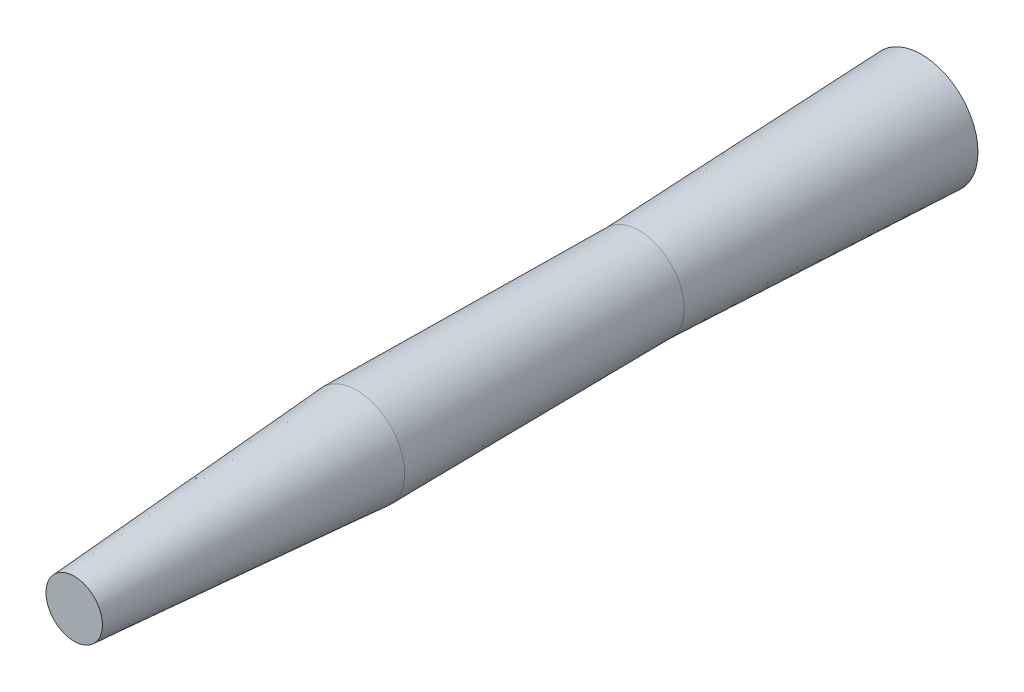
ISO-10303-21;
HEADER;
FILE_DESCRIPTION(('STEP AP214'),'2;1');
FILE_NAME('part.step','',(''),(''),'','','');
FILE_SCHEMA(('AUTOMOTIVE_DESIGN { 1 0 10303 214 1 1 1 1 }'));
ENDSEC;
DATA;
#1=APPLICATION_CONTEXT('core data for automotive mechanical design processes');
#2=APPLICATION_PROTOCOL_DEFINITION('international standard','automotive_design',2000,#1);
#3=PRODUCT_CONTEXT('',#1,'mechanical');
#4=PRODUCT('Part','Part','',(#3));
#5=PRODUCT_RELATED_PRODUCT_CATEGORY('part','',(#4));
#6=PRODUCT_DEFINITION_FORMATION('','',#4);
#7=PRODUCT_DEFINITION_CONTEXT('part definition',#1,'design');
#8=PRODUCT_DEFINITION('design','',#6,#7);
#9=PRODUCT_DEFINITION_SHAPE('','',#8);
#10=(LENGTH_UNIT() NAMED_UNIT(*) SI_UNIT(.MILLI.,.METRE.));
#11=(NAMED_UNIT(*) PLANE_ANGLE_UNIT() SI_UNIT($,.RADIAN.));
#12=(NAMED_UNIT(*) SI_UNIT($,.STERADIAN.) SOLID_ANGLE_UNIT());
#13=UNCERTAINTY_MEASURE_WITH_UNIT(LENGTH_MEASURE(1.E-05),#10,'distance_accuracy_value','');
#14=(GEOMETRIC_REPRESENTATION_CONTEXT(3) GLOBAL_UNCERTAINTY_ASSIGNED_CONTEXT((#13)) GLOBAL_UNIT_ASSIGNED_CONTEXT((#10,
#11,#12)) REPRESENTATION_CONTEXT('',''));
#15=CARTESIAN_POINT('',(0.,0.,0.));
#16=DIRECTION('',(0.,0.,1.));
#17=DIRECTION('',(1.,0.,0.));
#18=AXIS2_PLACEMENT_3D('',#15,#16,#17);
#19=CARTESIAN_POINT('',(0.,0.,0.));
#20=DIRECTION('',(0.,0.,1.));
#21=DIRECTION('',(1.,0.,0.));
#22=AXIS2_PLACEMENT_3D('',#19,#20,#21);
#23=PLANE('',#22);
#24=CARTESIAN_POINT('',(0.,0.,0.));
#25=DIRECTION('',(0.,0.,1.));
#26=DIRECTION('',(1.,0.,0.));
#27=AXIS2_PLACEMENT_3D('',#24,#25,#26);
#28=CIRCLE('',#27,20.);
#29=CARTESIAN_POINT('',(20.,0.,0.));
#30=VERTEX_POINT('',#29);
#31=EDGE_CURVE('E54',#30,#30,#28,.T.);
#32=ORIENTED_EDGE('',*,*,#31,.F.);
#33=EDGE_LOOP('',(#32));
#34=FACE_BOUND('',#33,.T.);
#35=ADVANCED_FACE('F45',(#34),#23,.F.);
#36=CARTESIAN_POINT('',(0.,0.,100.));
#37=DIRECTION('',(0.,0.,-1.));
#38=DIRECTION('',(-1.,0.,0.));
#39=AXIS2_PLACEMENT_3D('',#36,#37,#38);
#40=CONICAL_SURFACE('',#39,16.,0.03997868712329);
#41=ORIENTED_EDGE('',*,*,#31,.T.);
#42=EDGE_LOOP('',(#41));
#43=FACE_BOUND('',#42,.T.);
#44=CARTESIAN_POINT('',(0.,0.,100.));
#45=DIRECTION('',(0.,0.,1.));
#46=DIRECTION('',(1.,0.,0.));
#47=AXIS2_PLACEMENT_3D('',#44,#45,#46);
#48=CIRCLE('',#47,16.);
#49=CARTESIAN_POINT('',(16.,0.,100.));
#50=VERTEX_POINT('',#49);
#51=EDGE_CURVE('E11',#50,#50,#48,.T.);
#52=ORIENTED_EDGE('',*,*,#51,.F.);
#53=EDGE_LOOP('',(#52));
#54=FACE_BOUND('',#53,.T.);
#55=ADVANCED_FACE('F47',(#43,#54),#40,.T.);
#56=CARTESIAN_POINT('',(0.,0.,100.));
#57=DIRECTION('',(0.,0.,1.));
#58=DIRECTION('',(1.,0.,0.));
#59=AXIS2_PLACEMENT_3D('',#56,#57,#58);
#60=CONICAL_SURFACE('',#59,16.,0.00999966668666525);
#61=ORIENTED_EDGE('',*,*,#51,.T.);
#62=EDGE_LOOP('',(#61));
#63=FACE_BOUND('',#62,.T.);
#64=CARTESIAN_POINT('',(0.,0.,200.));
#65=DIRECTION('',(0.,0.,1.));
#66=DIRECTION('',(1.,0.,0.));
#67=AXIS2_PLACEMENT_3D('',#64,#65,#66);
#68=CIRCLE('',#67,17.);
#69=CARTESIAN_POINT('',(17.,0.,200.));
#70=VERTEX_POINT('',#69);
#71=EDGE_CURVE('E59',#70,#70,#68,.T.);
#72=ORIENTED_EDGE('',*,*,#71,.F.);
#73=EDGE_LOOP('',(#72));
#74=FACE_BOUND('',#73,.T.);
#75=ADVANCED_FACE('F83',(#63,#74),#60,.T.);
#76=CARTESIAN_POINT('',(0.,0.,300.));
#77=DIRECTION('',(0.,0.,1.));
#78=DIRECTION('',(1.,0.,0.));
#79=AXIS2_PLACEMENT_3D('',#76,#77,#78);
#80=PLANE('',#79);
#81=CARTESIAN_POINT('',(0.,0.,300.));
#82=DIRECTION('',(0.,0.,1.));
#83=DIRECTION('',(1.,0.,0.));
#84=AXIS2_PLACEMENT_3D('',#81,#82,#83);
#85=CIRCLE('',#84,10.);
#86=CARTESIAN_POINT('',(10.,0.,300.));
#87=VERTEX_POINT('',#86);
#88=EDGE_CURVE('E66',#87,#87,#85,.T.);
#89=ORIENTED_EDGE('',*,*,#88,.T.);
#90=EDGE_LOOP('',(#89));
#91=FACE_BOUND('',#90,.T.);
#92=ADVANCED_FACE('F86',(#91),#80,.T.);
#93=CARTESIAN_POINT('',(0.,0.,300.));
#94=DIRECTION('',(0.,0.,-1.));
#95=DIRECTION('',(-1.,0.,0.));
#96=AXIS2_PLACEMENT_3D('',#93,#94,#95);
#97=CONICAL_SURFACE('',#96,10.,0.0698860016346425);
#98=ORIENTED_EDGE('',*,*,#71,.T.);
#99=EDGE_LOOP('',(#98));
#100=FACE_BOUND('',#99,.T.);
#101=ORIENTED_EDGE('',*,*,#88,.F.);
#102=EDGE_LOOP('',(#101));
#103=FACE_BOUND('',#102,.T.);
#104=ADVANCED_FACE('F87',(#100,#103),#97,.T.);
#105=CLOSED_SHELL('',(#35,#55,#75,#92,#104));
#106=MANIFOLD_SOLID_BREP('B2',#105);
#107=ADVANCED_BREP_SHAPE_REPRESENTATION('',(#18,#106),#14);
#108=SHAPE_DEFINITION_REPRESENTATION(#9,#107);
ENDSEC;
END-ISO-10303-21;
